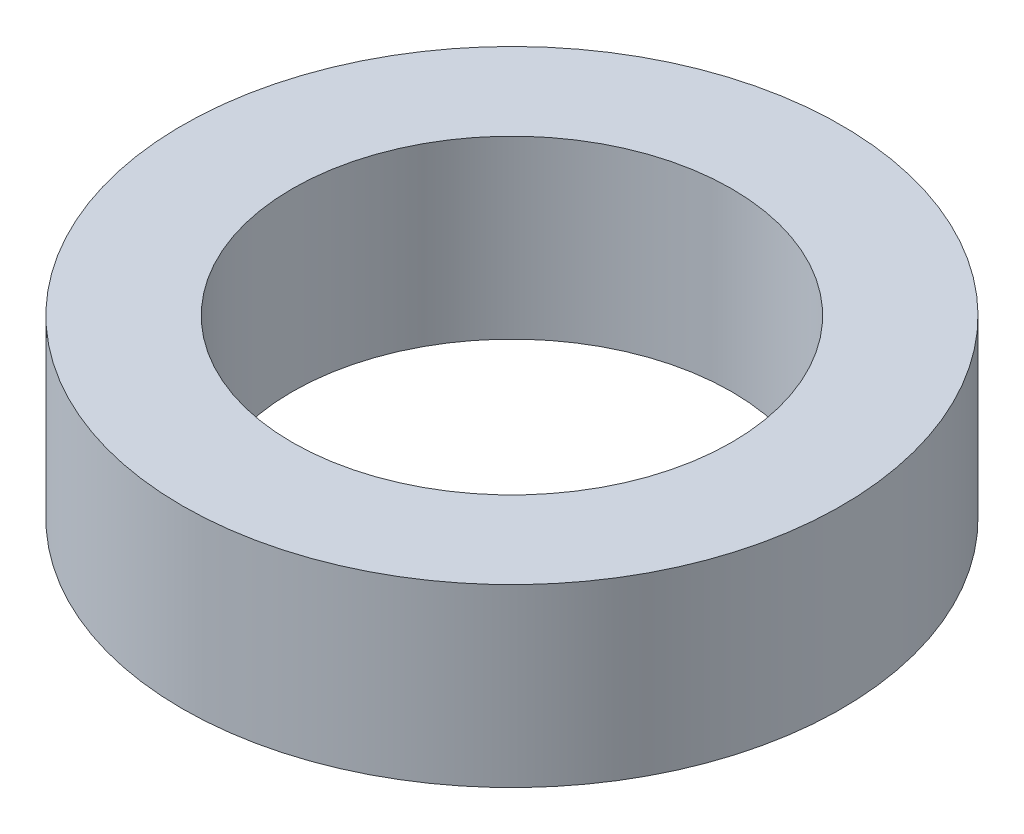
ISO-10303-21;
HEADER;
FILE_DESCRIPTION(('STEP AP214'),'2;1');
FILE_NAME('part.step','',(''),(''),'','','');
FILE_SCHEMA(('AUTOMOTIVE_DESIGN { 1 0 10303 214 1 1 1 1 }'));
ENDSEC;
DATA;
#1=APPLICATION_CONTEXT('core data for automotive mechanical design processes');
#2=APPLICATION_PROTOCOL_DEFINITION('international standard','automotive_design',2000,#1);
#3=PRODUCT_CONTEXT('',#1,'mechanical');
#4=PRODUCT('Part','Part','',(#3));
#5=PRODUCT_RELATED_PRODUCT_CATEGORY('part','',(#4));
#6=PRODUCT_DEFINITION_FORMATION('','',#4);
#7=PRODUCT_DEFINITION_CONTEXT('part definition',#1,'design');
#8=PRODUCT_DEFINITION('design','',#6,#7);
#9=PRODUCT_DEFINITION_SHAPE('','',#8);
#10=(LENGTH_UNIT() NAMED_UNIT(*) SI_UNIT(.MILLI.,.METRE.));
#11=(NAMED_UNIT(*) PLANE_ANGLE_UNIT() SI_UNIT($,.RADIAN.));
#12=(NAMED_UNIT(*) SI_UNIT($,.STERADIAN.) SOLID_ANGLE_UNIT());
#13=UNCERTAINTY_MEASURE_WITH_UNIT(LENGTH_MEASURE(1.E-05),#10,'distance_accuracy_value','');
#14=(GEOMETRIC_REPRESENTATION_CONTEXT(3) GLOBAL_UNCERTAINTY_ASSIGNED_CONTEXT((#13)) GLOBAL_UNIT_ASSIGNED_CONTEXT((#10,
#11,#12)) REPRESENTATION_CONTEXT('',''));
#15=CARTESIAN_POINT('',(0.,0.,0.));
#16=DIRECTION('',(0.,0.,1.));
#17=DIRECTION('',(1.,0.,0.));
#18=AXIS2_PLACEMENT_3D('',#15,#16,#17);
#19=CARTESIAN_POINT('',(0.,4.,0.));
#20=DIRECTION('',(0.,1.,0.));
#21=DIRECTION('',(0.,0.,1.));
#22=AXIS2_PLACEMENT_3D('',#19,#20,#21);
#23=PLANE('',#22);
#24=CARTESIAN_POINT('',(0.,4.,0.));
#25=DIRECTION('',(0.,1.,0.));
#26=DIRECTION('',(0.,0.,1.));
#27=AXIS2_PLACEMENT_3D('',#24,#25,#26);
#28=CIRCLE('',#27,7.5);
#29=CARTESIAN_POINT('',(0.,4.,7.5));
#30=VERTEX_POINT('',#29);
#31=EDGE_CURVE('E10',#30,#30,#28,.T.);
#32=ORIENTED_EDGE('',*,*,#31,.T.);
#33=EDGE_LOOP('',(#32));
#34=FACE_BOUND('',#33,.T.);
#35=CARTESIAN_POINT('',(0.,4.,0.));
#36=DIRECTION('',(0.,1.,0.));
#37=DIRECTION('',(0.,0.,1.));
#38=AXIS2_PLACEMENT_3D('',#35,#36,#37);
#39=CIRCLE('',#38,5.);
#40=CARTESIAN_POINT('',(0.,4.,5.));
#41=VERTEX_POINT('',#40);
#42=EDGE_CURVE('E50',#41,#41,#39,.T.);
#43=ORIENTED_EDGE('',*,*,#42,.F.);
#44=EDGE_LOOP('',(#43));
#45=FACE_BOUND('',#44,.T.);
#46=ADVANCED_FACE('F37',(#34,#45),#23,.T.);
#47=CARTESIAN_POINT('',(0.,0.,0.));
#48=DIRECTION('',(0.,1.,0.));
#49=DIRECTION('',(0.,0.,1.));
#50=AXIS2_PLACEMENT_3D('',#47,#48,#49);
#51=PLANE('',#50);
#52=CARTESIAN_POINT('',(0.,0.,0.));
#53=DIRECTION('',(0.,1.,0.));
#54=DIRECTION('',(0.,0.,1.));
#55=AXIS2_PLACEMENT_3D('',#52,#53,#54);
#56=CIRCLE('',#55,7.5);
#57=CARTESIAN_POINT('',(0.,0.,7.5));
#58=VERTEX_POINT('',#57);
#59=EDGE_CURVE('E41',#58,#58,#56,.T.);
#60=ORIENTED_EDGE('',*,*,#59,.F.);
#61=EDGE_LOOP('',(#60));
#62=FACE_BOUND('',#61,.T.);
#63=CARTESIAN_POINT('',(0.,0.,0.));
#64=DIRECTION('',(0.,1.,0.));
#65=DIRECTION('',(0.,0.,1.));
#66=AXIS2_PLACEMENT_3D('',#63,#64,#65);
#67=CIRCLE('',#66,5.);
#68=CARTESIAN_POINT('',(0.,0.,5.));
#69=VERTEX_POINT('',#68);
#70=EDGE_CURVE('E52',#69,#69,#67,.T.);
#71=ORIENTED_EDGE('',*,*,#70,.T.);
#72=EDGE_LOOP('',(#71));
#73=FACE_BOUND('',#72,.T.);
#74=ADVANCED_FACE('F64',(#62,#73),#51,.F.);
#75=CARTESIAN_POINT('',(0.,4.,0.));
#76=DIRECTION('',(0.,-1.,0.));
#77=DIRECTION('',(0.,0.,-1.));
#78=AXIS2_PLACEMENT_3D('',#75,#76,#77);
#79=CYLINDRICAL_SURFACE('',#78,7.5);
#80=ORIENTED_EDGE('',*,*,#31,.F.);
#81=EDGE_LOOP('',(#80));
#82=FACE_BOUND('',#81,.T.);
#83=ORIENTED_EDGE('',*,*,#59,.T.);
#84=EDGE_LOOP('',(#83));
#85=FACE_BOUND('',#84,.T.);
#86=ADVANCED_FACE('F39',(#82,#85),#79,.T.);
#87=CARTESIAN_POINT('',(0.,4.,0.));
#88=DIRECTION('',(0.,-1.,0.));
#89=DIRECTION('',(0.,0.,-1.));
#90=AXIS2_PLACEMENT_3D('',#87,#88,#89);
#91=CYLINDRICAL_SURFACE('',#90,5.);
#92=ORIENTED_EDGE('',*,*,#42,.T.);
#93=EDGE_LOOP('',(#92));
#94=FACE_BOUND('',#93,.T.);
#95=ORIENTED_EDGE('',*,*,#70,.F.);
#96=EDGE_LOOP('',(#95));
#97=FACE_BOUND('',#96,.T.);
#98=ADVANCED_FACE('F60',(#94,#97),#91,.F.);
#99=CLOSED_SHELL('',(#46,#74,#86,#98));
#100=MANIFOLD_SOLID_BREP('B2',#99);
#101=ADVANCED_BREP_SHAPE_REPRESENTATION('',(#18,#100),#14);
#102=SHAPE_DEFINITION_REPRESENTATION(#9,#101);
ENDSEC;
END-ISO-10303-21;
